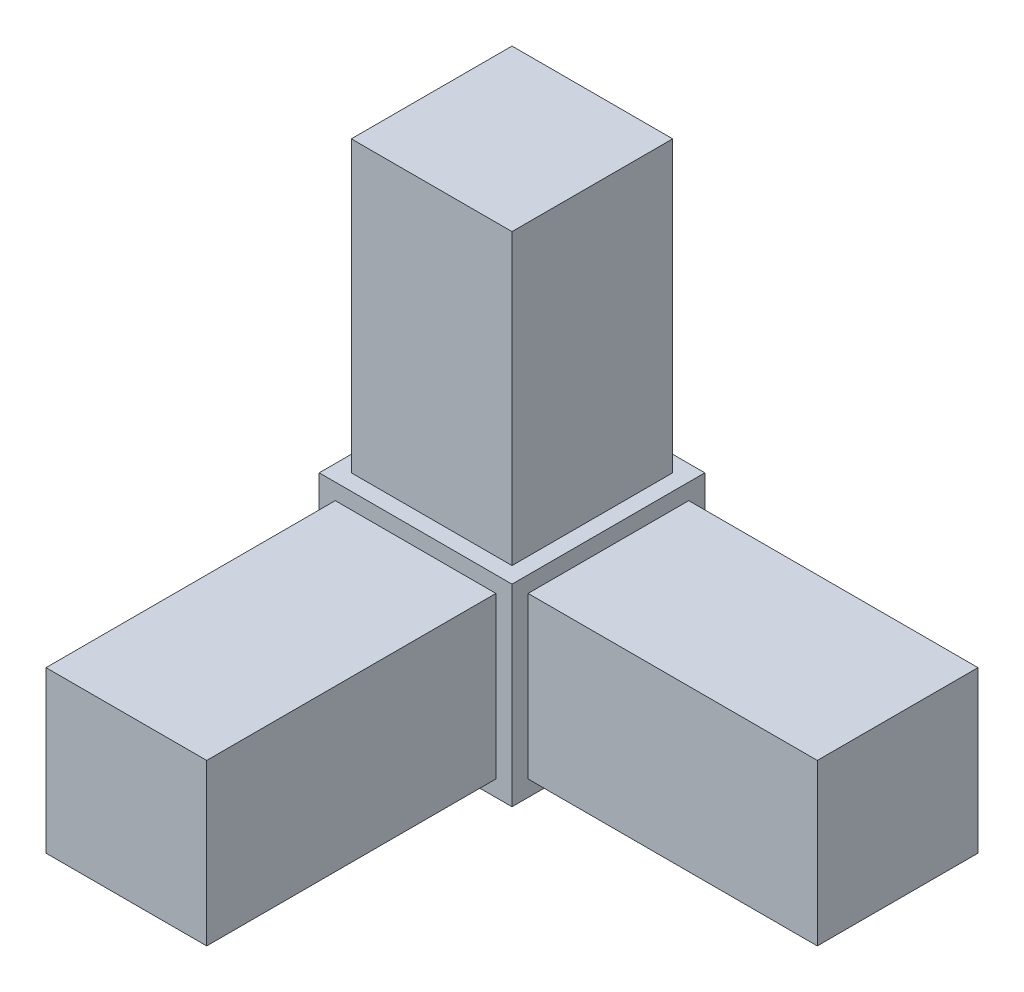
ISO-10303-21;
HEADER;
FILE_DESCRIPTION(('STEP AP214'),'2;1');
FILE_NAME('part.step','',(''),(''),'','','');
FILE_SCHEMA(('AUTOMOTIVE_DESIGN { 1 0 10303 214 1 1 1 1 }'));
ENDSEC;
DATA;
#1=APPLICATION_CONTEXT('core data for automotive mechanical design processes');
#2=APPLICATION_PROTOCOL_DEFINITION('international standard','automotive_design',2000,#1);
#3=PRODUCT_CONTEXT('',#1,'mechanical');
#4=PRODUCT('Part','Part','',(#3));
#5=PRODUCT_RELATED_PRODUCT_CATEGORY('part','',(#4));
#6=PRODUCT_DEFINITION_FORMATION('','',#4);
#7=PRODUCT_DEFINITION_CONTEXT('part definition',#1,'design');
#8=PRODUCT_DEFINITION('design','',#6,#7);
#9=PRODUCT_DEFINITION_SHAPE('','',#8);
#10=(LENGTH_UNIT() NAMED_UNIT(*) SI_UNIT(.MILLI.,.METRE.));
#11=(NAMED_UNIT(*) PLANE_ANGLE_UNIT() SI_UNIT($,.RADIAN.));
#12=(NAMED_UNIT(*) SI_UNIT($,.STERADIAN.) SOLID_ANGLE_UNIT());
#13=UNCERTAINTY_MEASURE_WITH_UNIT(LENGTH_MEASURE(1.E-05),#10,'distance_accuracy_value','');
#14=(GEOMETRIC_REPRESENTATION_CONTEXT(3) GLOBAL_UNCERTAINTY_ASSIGNED_CONTEXT((#13)) GLOBAL_UNIT_ASSIGNED_CONTEXT((#10,
#11,#12)) REPRESENTATION_CONTEXT('',''));
#15=CARTESIAN_POINT('',(0.,0.,0.));
#16=DIRECTION('',(0.,0.,1.));
#17=DIRECTION('',(1.,0.,0.));
#18=AXIS2_PLACEMENT_3D('',#15,#16,#17);
#19=CARTESIAN_POINT('',(0.,0.,19.05));
#20=DIRECTION('',(0.,0.,1.));
#21=DIRECTION('',(1.,0.,0.));
#22=AXIS2_PLACEMENT_3D('',#19,#20,#21);
#23=PLANE('',#22);
#24=DIRECTION('',(0.,-1.,0.));
#25=VECTOR('',#24,1.);
#26=CARTESIAN_POINT('',(-9.525,-9.525,19.05));
#27=LINE('',#26,#25);
#28=CARTESIAN_POINT('',(-9.525,9.525,19.05));
#29=VERTEX_POINT('',#28);
#30=CARTESIAN_POINT('',(-9.525,-9.525,19.05));
#31=VERTEX_POINT('',#30);
#32=EDGE_CURVE('E238',#29,#31,#27,.T.);
#33=ORIENTED_EDGE('',*,*,#32,.T.);
#34=DIRECTION('',(1.,0.,0.));
#35=VECTOR('',#34,1.);
#36=CARTESIAN_POINT('',(9.525,-9.525,19.05));
#37=LINE('',#36,#35);
#38=CARTESIAN_POINT('',(9.525,-9.525,19.05));
#39=VERTEX_POINT('',#38);
#40=EDGE_CURVE('E241',#31,#39,#37,.T.);
#41=ORIENTED_EDGE('',*,*,#40,.T.);
#42=DIRECTION('',(0.,1.,0.));
#43=VECTOR('',#42,1.);
#44=CARTESIAN_POINT('',(9.525,-9.525,19.05));
#45=LINE('',#44,#43);
#46=CARTESIAN_POINT('',(9.525,9.525,19.05));
#47=VERTEX_POINT('',#46);
#48=EDGE_CURVE('E244',#39,#47,#45,.T.);
#49=ORIENTED_EDGE('',*,*,#48,.T.);
#50=DIRECTION('',(-1.,0.,0.));
#51=VECTOR('',#50,1.);
#52=CARTESIAN_POINT('',(9.525,9.525,19.05));
#53=LINE('',#52,#51);
#54=EDGE_CURVE('E246',#47,#29,#53,.T.);
#55=ORIENTED_EDGE('',*,*,#54,.T.);
#56=EDGE_LOOP('',(#33,#41,#49,#55));
#57=FACE_BOUND('',#56,.T.);
#58=DIRECTION('',(1.,0.,0.));
#59=VECTOR('',#58,1.);
#60=CARTESIAN_POINT('',(7.9375,-7.9375,19.05));
#61=LINE('',#60,#59);
#62=CARTESIAN_POINT('',(-7.9375,-7.9375,19.05));
#63=VERTEX_POINT('',#62);
#64=CARTESIAN_POINT('',(7.9375,-7.9375,19.05));
#65=VERTEX_POINT('',#64);
#66=EDGE_CURVE('E478',#63,#65,#61,.T.);
#67=ORIENTED_EDGE('',*,*,#66,.F.);
#68=DIRECTION('',(0.,-1.,0.));
#69=VECTOR('',#68,1.);
#70=CARTESIAN_POINT('',(-7.9375,-7.9375,19.05));
#71=LINE('',#70,#69);
#72=CARTESIAN_POINT('',(-7.9375,7.9375,19.05));
#73=VERTEX_POINT('',#72);
#74=EDGE_CURVE('E168',#73,#63,#71,.T.);
#75=ORIENTED_EDGE('',*,*,#74,.F.);
#76=DIRECTION('',(-1.,0.,0.));
#77=VECTOR('',#76,1.);
#78=CARTESIAN_POINT('',(7.9375,7.9375,19.05));
#79=LINE('',#78,#77);
#80=CARTESIAN_POINT('',(7.9375,7.9375,19.05));
#81=VERTEX_POINT('',#80);
#82=EDGE_CURVE('E164',#81,#73,#79,.T.);
#83=ORIENTED_EDGE('',*,*,#82,.F.);
#84=DIRECTION('',(0.,1.,0.));
#85=VECTOR('',#84,1.);
#86=CARTESIAN_POINT('',(7.9375,-7.9375,19.05));
#87=LINE('',#86,#85);
#88=EDGE_CURVE('E475',#65,#81,#87,.T.);
#89=ORIENTED_EDGE('',*,*,#88,.F.);
#90=EDGE_LOOP('',(#67,#75,#83,#89));
#91=FACE_BOUND('',#90,.T.);
#92=ADVANCED_FACE('F32',(#57,#91),#23,.T.);
#93=CARTESIAN_POINT('',(9.525,-9.525,19.05));
#94=DIRECTION('',(-1.,0.,0.));
#95=DIRECTION('',(0.,0.,1.));
#96=AXIS2_PLACEMENT_3D('',#93,#94,#95);
#97=PLANE('',#96);
#98=DIRECTION('',(0.,1.,0.));
#99=VECTOR('',#98,1.);
#100=CARTESIAN_POINT('',(9.525,-9.525,0.));
#101=LINE('',#100,#99);
#102=CARTESIAN_POINT('',(9.525,-9.525,0.));
#103=VERTEX_POINT('',#102);
#104=CARTESIAN_POINT('',(9.525,9.525,0.));
#105=VERTEX_POINT('',#104);
#106=EDGE_CURVE('E253',#103,#105,#101,.T.);
#107=ORIENTED_EDGE('',*,*,#106,.T.);
#108=DIRECTION('',(0.,0.,-1.));
#109=VECTOR('',#108,1.);
#110=CARTESIAN_POINT('',(9.525,9.525,19.05));
#111=LINE('',#110,#109);
#112=EDGE_CURVE('E258',#47,#105,#111,.T.);
#113=ORIENTED_EDGE('',*,*,#112,.F.);
#114=ORIENTED_EDGE('',*,*,#48,.F.);
#115=DIRECTION('',(0.,0.,-1.));
#116=VECTOR('',#115,1.);
#117=CARTESIAN_POINT('',(9.525,-9.525,19.05));
#118=LINE('',#117,#116);
#119=EDGE_CURVE('E40',#39,#103,#118,.T.);
#120=ORIENTED_EDGE('',*,*,#119,.T.);
#121=EDGE_LOOP('',(#107,#113,#114,#120));
#122=FACE_BOUND('',#121,.T.);
#123=DIRECTION('',(0.,1.,0.));
#124=VECTOR('',#123,1.);
#125=CARTESIAN_POINT('',(9.525,-7.93749999999999,1.5875));
#126=LINE('',#125,#124);
#127=CARTESIAN_POINT('',(9.525,-7.93749999999999,1.5875));
#128=VERTEX_POINT('',#127);
#129=CARTESIAN_POINT('',(9.525,7.93750000000001,1.58750000000001));
#130=VERTEX_POINT('',#129);
#131=EDGE_CURVE('E170',#128,#130,#126,.T.);
#132=ORIENTED_EDGE('',*,*,#131,.F.);
#133=DIRECTION('',(0.,0.,-1.));
#134=VECTOR('',#133,1.);
#135=CARTESIAN_POINT('',(9.525,-7.93749999999999,17.4625));
#136=LINE('',#135,#134);
#137=CARTESIAN_POINT('',(9.525,-7.93749999999999,17.4625));
#138=VERTEX_POINT('',#137);
#139=EDGE_CURVE('E181',#138,#128,#136,.T.);
#140=ORIENTED_EDGE('',*,*,#139,.F.);
#141=DIRECTION('',(0.,-1.,0.));
#142=VECTOR('',#141,1.);
#143=CARTESIAN_POINT('',(9.525,-7.93749999999999,17.4625));
#144=LINE('',#143,#142);
#145=CARTESIAN_POINT('',(9.525,7.9375,17.4625));
#146=VERTEX_POINT('',#145);
#147=EDGE_CURVE('E189',#146,#138,#144,.T.);
#148=ORIENTED_EDGE('',*,*,#147,.F.);
#149=DIRECTION('',(0.,0.,1.));
#150=VECTOR('',#149,1.);
#151=CARTESIAN_POINT('',(9.525,7.93750000000001,17.4625));
#152=LINE('',#151,#150);
#153=EDGE_CURVE('E55',#130,#146,#152,.T.);
#154=ORIENTED_EDGE('',*,*,#153,.F.);
#155=EDGE_LOOP('',(#132,#140,#148,#154));
#156=FACE_BOUND('',#155,.T.);
#157=ADVANCED_FACE('F265',(#122,#156),#97,.F.);
#158=CARTESIAN_POINT('',(9.525,9.525,19.05));
#159=DIRECTION('',(0.,-1.,0.));
#160=DIRECTION('',(1.,0.,0.));
#161=AXIS2_PLACEMENT_3D('',#158,#159,#160);
#162=PLANE('',#161);
#163=DIRECTION('',(-1.,0.,0.));
#164=VECTOR('',#163,1.);
#165=CARTESIAN_POINT('',(9.525,9.525,0.));
#166=LINE('',#165,#164);
#167=CARTESIAN_POINT('',(-9.525,9.525,0.));
#168=VERTEX_POINT('',#167);
#169=EDGE_CURVE('E242',#105,#168,#166,.T.);
#170=ORIENTED_EDGE('',*,*,#169,.T.);
#171=DIRECTION('',(0.,0.,-1.));
#172=VECTOR('',#171,1.);
#173=CARTESIAN_POINT('',(-9.525,9.525,19.05));
#174=LINE('',#173,#172);
#175=EDGE_CURVE('E248',#29,#168,#174,.T.);
#176=ORIENTED_EDGE('',*,*,#175,.F.);
#177=ORIENTED_EDGE('',*,*,#54,.F.);
#178=ORIENTED_EDGE('',*,*,#112,.T.);
#179=EDGE_LOOP('',(#170,#176,#177,#178));
#180=FACE_BOUND('',#179,.T.);
#181=DIRECTION('',(0.,0.,-1.));
#182=VECTOR('',#181,1.);
#183=CARTESIAN_POINT('',(7.9375,9.525,1.58750000000001));
#184=LINE('',#183,#182);
#185=CARTESIAN_POINT('',(7.9375,9.525,17.4625));
#186=VERTEX_POINT('',#185);
#187=CARTESIAN_POINT('',(7.9375,9.525,1.58750000000001));
#188=VERTEX_POINT('',#187);
#189=EDGE_CURVE('E204',#186,#188,#184,.T.);
#190=ORIENTED_EDGE('',*,*,#189,.F.);
#191=DIRECTION('',(1.,0.,0.));
#192=VECTOR('',#191,1.);
#193=CARTESIAN_POINT('',(-7.9375,9.525,17.4625));
#194=LINE('',#193,#192);
#195=CARTESIAN_POINT('',(-7.9375,9.525,17.4625));
#196=VERTEX_POINT('',#195);
#197=EDGE_CURVE('E209',#196,#186,#194,.T.);
#198=ORIENTED_EDGE('',*,*,#197,.F.);
#199=DIRECTION('',(0.,0.,1.));
#200=VECTOR('',#199,1.);
#201=CARTESIAN_POINT('',(-7.9375,9.525,1.58750000000001));
#202=LINE('',#201,#200);
#203=CARTESIAN_POINT('',(-7.9375,9.525,1.58750000000001));
#204=VERTEX_POINT('',#203);
#205=EDGE_CURVE('E221',#204,#196,#202,.T.);
#206=ORIENTED_EDGE('',*,*,#205,.F.);
#207=DIRECTION('',(-1.,0.,0.));
#208=VECTOR('',#207,1.);
#209=CARTESIAN_POINT('',(-7.9375,9.525,1.58750000000001));
#210=LINE('',#209,#208);
#211=EDGE_CURVE('E218',#188,#204,#210,.T.);
#212=ORIENTED_EDGE('',*,*,#211,.F.);
#213=EDGE_LOOP('',(#190,#198,#206,#212));
#214=FACE_BOUND('',#213,.T.);
#215=ADVANCED_FACE('F274',(#180,#214),#162,.F.);
#216=CARTESIAN_POINT('',(-9.525,-9.525,19.05));
#217=DIRECTION('',(1.,0.,0.));
#218=DIRECTION('',(0.,0.,-1.));
#219=AXIS2_PLACEMENT_3D('',#216,#217,#218);
#220=PLANE('',#219);
#221=DIRECTION('',(0.,-1.,0.));
#222=VECTOR('',#221,1.);
#223=CARTESIAN_POINT('',(-9.525,-9.525,0.));
#224=LINE('',#223,#222);
#225=CARTESIAN_POINT('',(-9.525,-9.525,0.));
#226=VERTEX_POINT('',#225);
#227=EDGE_CURVE('E237',#168,#226,#224,.T.);
#228=ORIENTED_EDGE('',*,*,#227,.T.);
#229=DIRECTION('',(0.,0.,-1.));
#230=VECTOR('',#229,1.);
#231=CARTESIAN_POINT('',(-9.525,-9.525,19.05));
#232=LINE('',#231,#230);
#233=EDGE_CURVE('E11',#31,#226,#232,.T.);
#234=ORIENTED_EDGE('',*,*,#233,.F.);
#235=ORIENTED_EDGE('',*,*,#32,.F.);
#236=ORIENTED_EDGE('',*,*,#175,.T.);
#237=EDGE_LOOP('',(#228,#234,#235,#236));
#238=FACE_BOUND('',#237,.T.);
#239=ADVANCED_FACE('F34',(#238),#220,.F.);
#240=CARTESIAN_POINT('',(9.525,-9.525,19.05));
#241=DIRECTION('',(0.,1.,0.));
#242=DIRECTION('',(-1.,0.,0.));
#243=AXIS2_PLACEMENT_3D('',#240,#241,#242);
#244=PLANE('',#243);
#245=DIRECTION('',(1.,0.,0.));
#246=VECTOR('',#245,1.);
#247=CARTESIAN_POINT('',(9.525,-9.525,0.));
#248=LINE('',#247,#246);
#249=EDGE_CURVE('E251',#226,#103,#248,.T.);
#250=ORIENTED_EDGE('',*,*,#249,.T.);
#251=ORIENTED_EDGE('',*,*,#119,.F.);
#252=ORIENTED_EDGE('',*,*,#40,.F.);
#253=ORIENTED_EDGE('',*,*,#233,.T.);
#254=EDGE_LOOP('',(#250,#251,#252,#253));
#255=FACE_BOUND('',#254,.T.);
#256=ADVANCED_FACE('F282',(#255),#244,.F.);
#257=CARTESIAN_POINT('',(0.,0.,0.));
#258=DIRECTION('',(0.,0.,1.));
#259=DIRECTION('',(1.,0.,0.));
#260=AXIS2_PLACEMENT_3D('',#257,#258,#259);
#261=PLANE('',#260);
#262=ORIENTED_EDGE('',*,*,#227,.F.);
#263=ORIENTED_EDGE('',*,*,#169,.F.);
#264=ORIENTED_EDGE('',*,*,#106,.F.);
#265=ORIENTED_EDGE('',*,*,#249,.F.);
#266=EDGE_LOOP('',(#262,#263,#264,#265));
#267=FACE_BOUND('',#266,.T.);
#268=ADVANCED_FACE('F271',(#267),#261,.F.);
#269=CARTESIAN_POINT('',(7.9375,38.1,1.58750000000001));
#270=DIRECTION('',(-1.,0.,0.));
#271=DIRECTION('',(0.,0.,1.));
#272=AXIS2_PLACEMENT_3D('',#269,#270,#271);
#273=PLANE('',#272);
#274=ORIENTED_EDGE('',*,*,#189,.T.);
#275=DIRECTION('',(0.,-1.,0.));
#276=VECTOR('',#275,1.);
#277=CARTESIAN_POINT('',(7.9375,38.1,1.58750000000001));
#278=LINE('',#277,#276);
#279=CARTESIAN_POINT('',(7.9375,38.1,1.58750000000001));
#280=VERTEX_POINT('',#279);
#281=EDGE_CURVE('E234',#280,#188,#278,.T.);
#282=ORIENTED_EDGE('',*,*,#281,.F.);
#283=DIRECTION('',(0.,0.,-1.));
#284=VECTOR('',#283,1.);
#285=CARTESIAN_POINT('',(7.9375,38.1,1.58750000000001));
#286=LINE('',#285,#284);
#287=CARTESIAN_POINT('',(7.9375,38.1,17.4625));
#288=VERTEX_POINT('',#287);
#289=EDGE_CURVE('E205',#288,#280,#286,.T.);
#290=ORIENTED_EDGE('',*,*,#289,.F.);
#291=DIRECTION('',(0.,-1.,0.));
#292=VECTOR('',#291,1.);
#293=CARTESIAN_POINT('',(7.9375,38.1,17.4625));
#294=LINE('',#293,#292);
#295=EDGE_CURVE('E215',#288,#186,#294,.T.);
#296=ORIENTED_EDGE('',*,*,#295,.T.);
#297=EDGE_LOOP('',(#274,#282,#290,#296));
#298=FACE_BOUND('',#297,.T.);
#299=ADVANCED_FACE('F288',(#298),#273,.F.);
#300=CARTESIAN_POINT('',(-7.9375,38.1,1.58750000000001));
#301=DIRECTION('',(0.,0.,1.));
#302=DIRECTION('',(1.,0.,0.));
#303=AXIS2_PLACEMENT_3D('',#300,#301,#302);
#304=PLANE('',#303);
#305=ORIENTED_EDGE('',*,*,#211,.T.);
#306=DIRECTION('',(0.,-1.,0.));
#307=VECTOR('',#306,1.);
#308=CARTESIAN_POINT('',(-7.9375,38.1,1.58750000000001));
#309=LINE('',#308,#307);
#310=CARTESIAN_POINT('',(-7.9375,38.1,1.58750000000001));
#311=VERTEX_POINT('',#310);
#312=EDGE_CURVE('E231',#311,#204,#309,.T.);
#313=ORIENTED_EDGE('',*,*,#312,.F.);
#314=DIRECTION('',(-1.,0.,0.));
#315=VECTOR('',#314,1.);
#316=CARTESIAN_POINT('',(-7.9375,38.1,1.58750000000001));
#317=LINE('',#316,#315);
#318=EDGE_CURVE('E208',#280,#311,#317,.T.);
#319=ORIENTED_EDGE('',*,*,#318,.F.);
#320=ORIENTED_EDGE('',*,*,#281,.T.);
#321=EDGE_LOOP('',(#305,#313,#319,#320));
#322=FACE_BOUND('',#321,.T.);
#323=ADVANCED_FACE('F326',(#322),#304,.F.);
#324=CARTESIAN_POINT('',(-7.9375,38.1,1.58750000000001));
#325=DIRECTION('',(1.,0.,0.));
#326=DIRECTION('',(0.,0.,-1.));
#327=AXIS2_PLACEMENT_3D('',#324,#325,#326);
#328=PLANE('',#327);
#329=ORIENTED_EDGE('',*,*,#205,.T.);
#330=DIRECTION('',(0.,-1.,0.));
#331=VECTOR('',#330,1.);
#332=CARTESIAN_POINT('',(-7.9375,38.1,17.4625));
#333=LINE('',#332,#331);
#334=CARTESIAN_POINT('',(-7.9375,38.1,17.4625));
#335=VERTEX_POINT('',#334);
#336=EDGE_CURVE('E228',#335,#196,#333,.T.);
#337=ORIENTED_EDGE('',*,*,#336,.F.);
#338=DIRECTION('',(0.,0.,1.));
#339=VECTOR('',#338,1.);
#340=CARTESIAN_POINT('',(-7.9375,38.1,1.58750000000001));
#341=LINE('',#340,#339);
#342=EDGE_CURVE('E211',#311,#335,#341,.T.);
#343=ORIENTED_EDGE('',*,*,#342,.F.);
#344=ORIENTED_EDGE('',*,*,#312,.T.);
#345=EDGE_LOOP('',(#329,#337,#343,#344));
#346=FACE_BOUND('',#345,.T.);
#347=ADVANCED_FACE('F333',(#346),#328,.F.);
#348=CARTESIAN_POINT('',(-7.9375,38.1,17.4625));
#349=DIRECTION('',(0.,0.,-1.));
#350=DIRECTION('',(-1.,0.,0.));
#351=AXIS2_PLACEMENT_3D('',#348,#349,#350);
#352=PLANE('',#351);
#353=ORIENTED_EDGE('',*,*,#197,.T.);
#354=ORIENTED_EDGE('',*,*,#295,.F.);
#355=DIRECTION('',(1.,0.,0.));
#356=VECTOR('',#355,1.);
#357=CARTESIAN_POINT('',(-7.9375,38.1,17.4625));
#358=LINE('',#357,#356);
#359=EDGE_CURVE('E213',#335,#288,#358,.T.);
#360=ORIENTED_EDGE('',*,*,#359,.F.);
#361=ORIENTED_EDGE('',*,*,#336,.T.);
#362=EDGE_LOOP('',(#353,#354,#360,#361));
#363=FACE_BOUND('',#362,.T.);
#364=ADVANCED_FACE('F340',(#363),#352,.F.);
#365=CARTESIAN_POINT('',(0.,38.1,0.));
#366=DIRECTION('',(0.,1.,0.));
#367=DIRECTION('',(0.,0.,1.));
#368=AXIS2_PLACEMENT_3D('',#365,#366,#367);
#369=PLANE('',#368);
#370=ORIENTED_EDGE('',*,*,#289,.T.);
#371=ORIENTED_EDGE('',*,*,#318,.T.);
#372=ORIENTED_EDGE('',*,*,#342,.T.);
#373=ORIENTED_EDGE('',*,*,#359,.T.);
#374=EDGE_LOOP('',(#370,#371,#372,#373));
#375=FACE_BOUND('',#374,.T.);
#376=ADVANCED_FACE('F348',(#375),#369,.T.);
#377=CARTESIAN_POINT('',(38.1,-7.93749999999999,1.5875));
#378=DIRECTION('',(0.,0.,1.));
#379=DIRECTION('',(1.,0.,0.));
#380=AXIS2_PLACEMENT_3D('',#377,#378,#379);
#381=PLANE('',#380);
#382=ORIENTED_EDGE('',*,*,#131,.T.);
#383=DIRECTION('',(-1.,0.,0.));
#384=VECTOR('',#383,1.);
#385=CARTESIAN_POINT('',(38.1,7.93750000000001,1.5875));
#386=LINE('',#385,#384);
#387=CARTESIAN_POINT('',(38.1,7.93750000000001,1.5875));
#388=VERTEX_POINT('',#387);
#389=EDGE_CURVE('E202',#388,#130,#386,.T.);
#390=ORIENTED_EDGE('',*,*,#389,.F.);
#391=DIRECTION('',(0.,1.,0.));
#392=VECTOR('',#391,1.);
#393=CARTESIAN_POINT('',(38.1,-7.93749999999999,1.5875));
#394=LINE('',#393,#392);
#395=CARTESIAN_POINT('',(38.1,-7.93749999999999,1.5875));
#396=VERTEX_POINT('',#395);
#397=EDGE_CURVE('E177',#396,#388,#394,.T.);
#398=ORIENTED_EDGE('',*,*,#397,.F.);
#399=DIRECTION('',(-1.,0.,0.));
#400=VECTOR('',#399,1.);
#401=CARTESIAN_POINT('',(38.1,-7.93749999999999,1.5875));
#402=LINE('',#401,#400);
#403=EDGE_CURVE('E186',#396,#128,#402,.T.);
#404=ORIENTED_EDGE('',*,*,#403,.T.);
#405=EDGE_LOOP('',(#382,#390,#398,#404));
#406=FACE_BOUND('',#405,.T.);
#407=ADVANCED_FACE('F356',(#406),#381,.F.);
#408=CARTESIAN_POINT('',(38.1,7.93750000000001,17.4625));
#409=DIRECTION('',(0.,-1.,0.));
#410=DIRECTION('',(0.,0.,-1.));
#411=AXIS2_PLACEMENT_3D('',#408,#409,#410);
#412=PLANE('',#411);
#413=ORIENTED_EDGE('',*,*,#153,.T.);
#414=DIRECTION('',(-1.,0.,0.));
#415=VECTOR('',#414,1.);
#416=CARTESIAN_POINT('',(38.1,7.93750000000001,17.4625));
#417=LINE('',#416,#415);
#418=CARTESIAN_POINT('',(38.1,7.93750000000001,17.4625));
#419=VERTEX_POINT('',#418);
#420=EDGE_CURVE('E199',#419,#146,#417,.T.);
#421=ORIENTED_EDGE('',*,*,#420,.F.);
#422=DIRECTION('',(0.,0.,1.));
#423=VECTOR('',#422,1.);
#424=CARTESIAN_POINT('',(38.1,7.93750000000001,17.4625));
#425=LINE('',#424,#423);
#426=EDGE_CURVE('E180',#388,#419,#425,.T.);
#427=ORIENTED_EDGE('',*,*,#426,.F.);
#428=ORIENTED_EDGE('',*,*,#389,.T.);
#429=EDGE_LOOP('',(#413,#421,#427,#428));
#430=FACE_BOUND('',#429,.T.);
#431=ADVANCED_FACE('F364',(#430),#412,.F.);
#432=CARTESIAN_POINT('',(38.1,-7.93749999999999,17.4625));
#433=DIRECTION('',(0.,0.,-1.));
#434=DIRECTION('',(0.,1.,0.));
#435=AXIS2_PLACEMENT_3D('',#432,#433,#434);
#436=PLANE('',#435);
#437=ORIENTED_EDGE('',*,*,#147,.T.);
#438=DIRECTION('',(-1.,0.,0.));
#439=VECTOR('',#438,1.);
#440=CARTESIAN_POINT('',(38.1,-7.93749999999999,17.4625));
#441=LINE('',#440,#439);
#442=CARTESIAN_POINT('',(38.1,-7.93749999999999,17.4625));
#443=VERTEX_POINT('',#442);
#444=EDGE_CURVE('E196',#443,#138,#441,.T.);
#445=ORIENTED_EDGE('',*,*,#444,.F.);
#446=DIRECTION('',(0.,-1.,0.));
#447=VECTOR('',#446,1.);
#448=CARTESIAN_POINT('',(38.1,-7.93749999999999,17.4625));
#449=LINE('',#448,#447);
#450=EDGE_CURVE('E183',#419,#443,#449,.T.);
#451=ORIENTED_EDGE('',*,*,#450,.F.);
#452=ORIENTED_EDGE('',*,*,#420,.T.);
#453=EDGE_LOOP('',(#437,#445,#451,#452));
#454=FACE_BOUND('',#453,.T.);
#455=ADVANCED_FACE('F372',(#454),#436,.F.);
#456=CARTESIAN_POINT('',(38.1,-7.93749999999999,17.4625));
#457=DIRECTION('',(0.,1.,0.));
#458=DIRECTION('',(0.,0.,1.));
#459=AXIS2_PLACEMENT_3D('',#456,#457,#458);
#460=PLANE('',#459);
#461=ORIENTED_EDGE('',*,*,#139,.T.);
#462=ORIENTED_EDGE('',*,*,#403,.F.);
#463=DIRECTION('',(0.,0.,-1.));
#464=VECTOR('',#463,1.);
#465=CARTESIAN_POINT('',(38.1,-7.93749999999999,17.4625));
#466=LINE('',#465,#464);
#467=EDGE_CURVE('E185',#443,#396,#466,.T.);
#468=ORIENTED_EDGE('',*,*,#467,.F.);
#469=ORIENTED_EDGE('',*,*,#444,.T.);
#470=EDGE_LOOP('',(#461,#462,#468,#469));
#471=FACE_BOUND('',#470,.T.);
#472=ADVANCED_FACE('F380',(#471),#460,.F.);
#473=CARTESIAN_POINT('',(38.1,0.,0.));
#474=DIRECTION('',(-1.,0.,0.));
#475=DIRECTION('',(0.,0.,1.));
#476=AXIS2_PLACEMENT_3D('',#473,#474,#475);
#477=PLANE('',#476);
#478=ORIENTED_EDGE('',*,*,#397,.T.);
#479=ORIENTED_EDGE('',*,*,#426,.T.);
#480=ORIENTED_EDGE('',*,*,#450,.T.);
#481=ORIENTED_EDGE('',*,*,#467,.T.);
#482=EDGE_LOOP('',(#478,#479,#480,#481));
#483=FACE_BOUND('',#482,.T.);
#484=ADVANCED_FACE('F388',(#483),#477,.F.);
#485=CARTESIAN_POINT('',(-7.9375,-7.9375,47.625));
#486=DIRECTION('',(1.,0.,0.));
#487=DIRECTION('',(0.,0.,-1.));
#488=AXIS2_PLACEMENT_3D('',#485,#486,#487);
#489=PLANE('',#488);
#490=ORIENTED_EDGE('',*,*,#74,.T.);
#491=DIRECTION('',(0.,0.,-1.));
#492=VECTOR('',#491,1.);
#493=CARTESIAN_POINT('',(-7.9375,-7.9375,47.625));
#494=LINE('',#493,#492);
#495=CARTESIAN_POINT('',(-7.9375,-7.9375,47.625));
#496=VERTEX_POINT('',#495);
#497=EDGE_CURVE('E149',#496,#63,#494,.T.);
#498=ORIENTED_EDGE('',*,*,#497,.F.);
#499=DIRECTION('',(0.,-1.,0.));
#500=VECTOR('',#499,1.);
#501=CARTESIAN_POINT('',(-7.9375,-7.9375,47.625));
#502=LINE('',#501,#500);
#503=CARTESIAN_POINT('',(-7.9375,7.9375,47.625));
#504=VERTEX_POINT('',#503);
#505=EDGE_CURVE('E156',#504,#496,#502,.T.);
#506=ORIENTED_EDGE('',*,*,#505,.F.);
#507=DIRECTION('',(0.,0.,-1.));
#508=VECTOR('',#507,1.);
#509=CARTESIAN_POINT('',(-7.9375,7.9375,47.625));
#510=LINE('',#509,#508);
#511=EDGE_CURVE('E473',#504,#73,#510,.T.);
#512=ORIENTED_EDGE('',*,*,#511,.T.);
#513=EDGE_LOOP('',(#490,#498,#506,#512));
#514=FACE_BOUND('',#513,.T.);
#515=ADVANCED_FACE('F166',(#514),#489,.F.);
#516=CARTESIAN_POINT('',(7.9375,-7.9375,47.625));
#517=DIRECTION('',(0.,1.,0.));
#518=DIRECTION('',(-1.,0.,0.));
#519=AXIS2_PLACEMENT_3D('',#516,#517,#518);
#520=PLANE('',#519);
#521=ORIENTED_EDGE('',*,*,#66,.T.);
#522=DIRECTION('',(0.,0.,-1.));
#523=VECTOR('',#522,1.);
#524=CARTESIAN_POINT('',(7.9375,-7.9375,47.625));
#525=LINE('',#524,#523);
#526=CARTESIAN_POINT('',(7.9375,-7.9375,47.625));
#527=VERTEX_POINT('',#526);
#528=EDGE_CURVE('E152',#527,#65,#525,.T.);
#529=ORIENTED_EDGE('',*,*,#528,.F.);
#530=DIRECTION('',(1.,0.,0.));
#531=VECTOR('',#530,1.);
#532=CARTESIAN_POINT('',(7.9375,-7.9375,47.625));
#533=LINE('',#532,#531);
#534=EDGE_CURVE('E145',#496,#527,#533,.T.);
#535=ORIENTED_EDGE('',*,*,#534,.F.);
#536=ORIENTED_EDGE('',*,*,#497,.T.);
#537=EDGE_LOOP('',(#521,#529,#535,#536));
#538=FACE_BOUND('',#537,.T.);
#539=ADVANCED_FACE('F147',(#538),#520,.F.);
#540=CARTESIAN_POINT('',(7.9375,-7.9375,47.625));
#541=DIRECTION('',(-1.,0.,0.));
#542=DIRECTION('',(0.,0.,1.));
#543=AXIS2_PLACEMENT_3D('',#540,#541,#542);
#544=PLANE('',#543);
#545=ORIENTED_EDGE('',*,*,#88,.T.);
#546=DIRECTION('',(0.,0.,-1.));
#547=VECTOR('',#546,1.);
#548=CARTESIAN_POINT('',(7.9375,7.9375,47.625));
#549=LINE('',#548,#547);
#550=CARTESIAN_POINT('',(7.9375,7.9375,47.625));
#551=VERTEX_POINT('',#550);
#552=EDGE_CURVE('E47',#551,#81,#549,.T.);
#553=ORIENTED_EDGE('',*,*,#552,.F.);
#554=DIRECTION('',(0.,1.,0.));
#555=VECTOR('',#554,1.);
#556=CARTESIAN_POINT('',(7.9375,-7.9375,47.625));
#557=LINE('',#556,#555);
#558=EDGE_CURVE('E155',#527,#551,#557,.T.);
#559=ORIENTED_EDGE('',*,*,#558,.F.);
#560=ORIENTED_EDGE('',*,*,#528,.T.);
#561=EDGE_LOOP('',(#545,#553,#559,#560));
#562=FACE_BOUND('',#561,.T.);
#563=ADVANCED_FACE('F409',(#562),#544,.F.);
#564=CARTESIAN_POINT('',(7.9375,7.9375,47.625));
#565=DIRECTION('',(0.,-1.,0.));
#566=DIRECTION('',(0.,0.,-1.));
#567=AXIS2_PLACEMENT_3D('',#564,#565,#566);
#568=PLANE('',#567);
#569=ORIENTED_EDGE('',*,*,#82,.T.);
#570=ORIENTED_EDGE('',*,*,#511,.F.);
#571=DIRECTION('',(-1.,0.,0.));
#572=VECTOR('',#571,1.);
#573=CARTESIAN_POINT('',(7.9375,7.9375,47.625));
#574=LINE('',#573,#572);
#575=EDGE_CURVE('E160',#551,#504,#574,.T.);
#576=ORIENTED_EDGE('',*,*,#575,.F.);
#577=ORIENTED_EDGE('',*,*,#552,.T.);
#578=EDGE_LOOP('',(#569,#570,#576,#577));
#579=FACE_BOUND('',#578,.T.);
#580=ADVANCED_FACE('F416',(#579),#568,.F.);
#581=CARTESIAN_POINT('',(0.,0.,47.625));
#582=DIRECTION('',(0.,0.,1.));
#583=DIRECTION('',(1.,0.,0.));
#584=AXIS2_PLACEMENT_3D('',#581,#582,#583);
#585=PLANE('',#584);
#586=ORIENTED_EDGE('',*,*,#505,.T.);
#587=ORIENTED_EDGE('',*,*,#534,.T.);
#588=ORIENTED_EDGE('',*,*,#558,.T.);
#589=ORIENTED_EDGE('',*,*,#575,.T.);
#590=EDGE_LOOP('',(#586,#587,#588,#589));
#591=FACE_BOUND('',#590,.T.);
#592=ADVANCED_FACE('F159',(#591),#585,.T.);
#593=CLOSED_SHELL('',(#92,#157,#215,#239,#256,#268,#299,#323,#347,#364,#376,#407,#431,#455,#472,
#484,#515,#539,#563,#580,#592));
#594=MANIFOLD_SOLID_BREP('B2',#593);
#595=ADVANCED_BREP_SHAPE_REPRESENTATION('',(#18,#594),#14);
#596=SHAPE_DEFINITION_REPRESENTATION(#9,#595);
ENDSEC;
END-ISO-10303-21;
